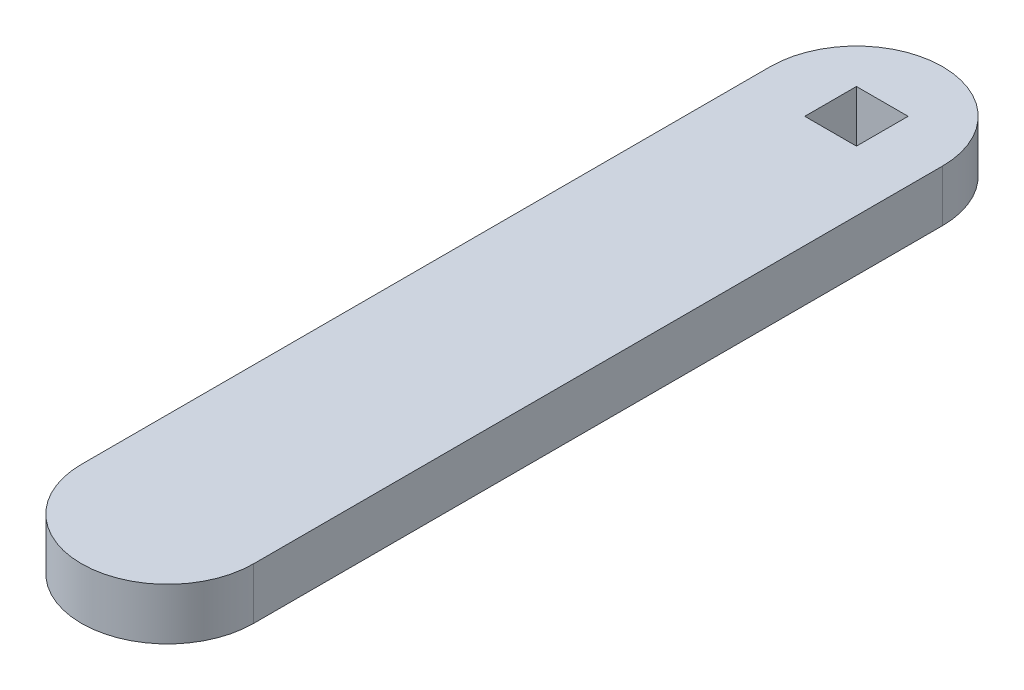
ISO-10303-21;
HEADER;
FILE_DESCRIPTION(('STEP AP214'),'2;1');
FILE_NAME('part.step','',(''),(''),'','','');
FILE_SCHEMA(('AUTOMOTIVE_DESIGN { 1 0 10303 214 1 1 1 1 }'));
ENDSEC;
DATA;
#1=APPLICATION_CONTEXT('core data for automotive mechanical design processes');
#2=APPLICATION_PROTOCOL_DEFINITION('international standard','automotive_design',2000,#1);
#3=PRODUCT_CONTEXT('',#1,'mechanical');
#4=PRODUCT('Part','Part','',(#3));
#5=PRODUCT_RELATED_PRODUCT_CATEGORY('part','',(#4));
#6=PRODUCT_DEFINITION_FORMATION('','',#4);
#7=PRODUCT_DEFINITION_CONTEXT('part definition',#1,'design');
#8=PRODUCT_DEFINITION('design','',#6,#7);
#9=PRODUCT_DEFINITION_SHAPE('','',#8);
#10=(LENGTH_UNIT() NAMED_UNIT(*) SI_UNIT(.MILLI.,.METRE.));
#11=(NAMED_UNIT(*) PLANE_ANGLE_UNIT() SI_UNIT($,.RADIAN.));
#12=(NAMED_UNIT(*) SI_UNIT($,.STERADIAN.) SOLID_ANGLE_UNIT());
#13=UNCERTAINTY_MEASURE_WITH_UNIT(LENGTH_MEASURE(1.E-05),#10,'distance_accuracy_value','');
#14=(GEOMETRIC_REPRESENTATION_CONTEXT(3) GLOBAL_UNCERTAINTY_ASSIGNED_CONTEXT((#13)) GLOBAL_UNIT_ASSIGNED_CONTEXT((#10,
#11,#12)) REPRESENTATION_CONTEXT('',''));
#15=CARTESIAN_POINT('',(0.,0.,0.));
#16=DIRECTION('',(0.,0.,1.));
#17=DIRECTION('',(1.,0.,0.));
#18=AXIS2_PLACEMENT_3D('',#15,#16,#17);
#19=CARTESIAN_POINT('',(0.,30.,-200.));
#20=DIRECTION('',(0.,-1.,0.));
#21=DIRECTION('',(0.,0.,-1.));
#22=AXIS2_PLACEMENT_3D('',#19,#20,#21);
#23=CYLINDRICAL_SURFACE('',#22,50.);
#24=CARTESIAN_POINT('',(0.,0.,-200.));
#25=DIRECTION('',(0.,1.,0.));
#26=DIRECTION('',(0.,0.,1.));
#27=AXIS2_PLACEMENT_3D('',#24,#25,#26);
#28=CIRCLE('',#27,50.);
#29=CARTESIAN_POINT('',(49.9999999999999,0.,-200.));
#30=VERTEX_POINT('',#29);
#31=CARTESIAN_POINT('',(-50.0000000000001,0.,-200.));
#32=VERTEX_POINT('',#31);
#33=EDGE_CURVE('E138',#30,#32,#28,.T.);
#34=ORIENTED_EDGE('',*,*,#33,.T.);
#35=DIRECTION('',(0.,-1.,0.));
#36=VECTOR('',#35,1.);
#37=CARTESIAN_POINT('',(-50.0000000000001,30.,-200.));
#38=LINE('',#37,#36);
#39=CARTESIAN_POINT('',(-50.0000000000001,30.,-200.));
#40=VERTEX_POINT('',#39);
#41=EDGE_CURVE('E11',#40,#32,#38,.T.);
#42=ORIENTED_EDGE('',*,*,#41,.F.);
#43=CARTESIAN_POINT('',(0.,30.,-200.));
#44=DIRECTION('',(0.,1.,0.));
#45=DIRECTION('',(0.,0.,1.));
#46=AXIS2_PLACEMENT_3D('',#43,#44,#45);
#47=CIRCLE('',#46,50.);
#48=CARTESIAN_POINT('',(49.9999999999999,30.,-200.));
#49=VERTEX_POINT('',#48);
#50=EDGE_CURVE('E142',#49,#40,#47,.T.);
#51=ORIENTED_EDGE('',*,*,#50,.F.);
#52=DIRECTION('',(0.,-1.,0.));
#53=VECTOR('',#52,1.);
#54=CARTESIAN_POINT('',(49.9999999999999,30.,-200.));
#55=LINE('',#54,#53);
#56=EDGE_CURVE('E152',#49,#30,#55,.T.);
#57=ORIENTED_EDGE('',*,*,#56,.T.);
#58=EDGE_LOOP('',(#34,#42,#51,#57));
#59=FACE_BOUND('',#58,.T.);
#60=ADVANCED_FACE('F41',(#59),#23,.T.);
#61=CARTESIAN_POINT('',(-50.0000000000001,30.,-200.));
#62=DIRECTION('',(1.,0.,0.));
#63=DIRECTION('',(0.,0.,-1.));
#64=AXIS2_PLACEMENT_3D('',#61,#62,#63);
#65=PLANE('',#64);
#66=DIRECTION('',(0.,0.,1.));
#67=VECTOR('',#66,1.);
#68=CARTESIAN_POINT('',(-50.0000000000001,0.,-200.));
#69=LINE('',#68,#67);
#70=CARTESIAN_POINT('',(-50.,0.,200.));
#71=VERTEX_POINT('',#70);
#72=EDGE_CURVE('E155',#32,#71,#69,.T.);
#73=ORIENTED_EDGE('',*,*,#72,.T.);
#74=DIRECTION('',(0.,-1.,0.));
#75=VECTOR('',#74,1.);
#76=CARTESIAN_POINT('',(-50.,30.,200.));
#77=LINE('',#76,#75);
#78=CARTESIAN_POINT('',(-50.,30.,200.));
#79=VERTEX_POINT('',#78);
#80=EDGE_CURVE('E48',#79,#71,#77,.T.);
#81=ORIENTED_EDGE('',*,*,#80,.F.);
#82=DIRECTION('',(0.,0.,1.));
#83=VECTOR('',#82,1.);
#84=CARTESIAN_POINT('',(-50.0000000000001,30.,-200.));
#85=LINE('',#84,#83);
#86=EDGE_CURVE('E145',#40,#79,#85,.T.);
#87=ORIENTED_EDGE('',*,*,#86,.F.);
#88=ORIENTED_EDGE('',*,*,#41,.T.);
#89=EDGE_LOOP('',(#73,#81,#87,#88));
#90=FACE_BOUND('',#89,.T.);
#91=ADVANCED_FACE('F183',(#90),#65,.F.);
#92=CARTESIAN_POINT('',(0.,30.,200.));
#93=DIRECTION('',(0.,-1.,0.));
#94=DIRECTION('',(0.,0.,-1.));
#95=AXIS2_PLACEMENT_3D('',#92,#93,#94);
#96=CYLINDRICAL_SURFACE('',#95,50.);
#97=CARTESIAN_POINT('',(0.,0.,200.));
#98=DIRECTION('',(0.,1.,0.));
#99=DIRECTION('',(0.,0.,1.));
#100=AXIS2_PLACEMENT_3D('',#97,#98,#99);
#101=CIRCLE('',#100,50.);
#102=CARTESIAN_POINT('',(50.,0.,200.));
#103=VERTEX_POINT('',#102);
#104=EDGE_CURVE('E157',#71,#103,#101,.T.);
#105=ORIENTED_EDGE('',*,*,#104,.T.);
#106=DIRECTION('',(0.,-1.,0.));
#107=VECTOR('',#106,1.);
#108=CARTESIAN_POINT('',(50.,30.,200.));
#109=LINE('',#108,#107);
#110=CARTESIAN_POINT('',(50.,30.,200.));
#111=VERTEX_POINT('',#110);
#112=EDGE_CURVE('E162',#111,#103,#109,.T.);
#113=ORIENTED_EDGE('',*,*,#112,.F.);
#114=CARTESIAN_POINT('',(0.,30.,200.));
#115=DIRECTION('',(0.,1.,0.));
#116=DIRECTION('',(0.,0.,1.));
#117=AXIS2_PLACEMENT_3D('',#114,#115,#116);
#118=CIRCLE('',#117,50.);
#119=EDGE_CURVE('E148',#79,#111,#118,.T.);
#120=ORIENTED_EDGE('',*,*,#119,.F.);
#121=ORIENTED_EDGE('',*,*,#80,.T.);
#122=EDGE_LOOP('',(#105,#113,#120,#121));
#123=FACE_BOUND('',#122,.T.);
#124=ADVANCED_FACE('F169',(#123),#96,.T.);
#125=CARTESIAN_POINT('',(49.9999999999999,30.,-200.));
#126=DIRECTION('',(-1.,0.,0.));
#127=DIRECTION('',(0.,0.,1.));
#128=AXIS2_PLACEMENT_3D('',#125,#126,#127);
#129=PLANE('',#128);
#130=DIRECTION('',(0.,0.,-1.));
#131=VECTOR('',#130,1.);
#132=CARTESIAN_POINT('',(49.9999999999999,0.,-200.));
#133=LINE('',#132,#131);
#134=EDGE_CURVE('E146',#103,#30,#133,.T.);
#135=ORIENTED_EDGE('',*,*,#134,.T.);
#136=ORIENTED_EDGE('',*,*,#56,.F.);
#137=DIRECTION('',(0.,0.,-1.));
#138=VECTOR('',#137,1.);
#139=CARTESIAN_POINT('',(49.9999999999999,30.,-200.));
#140=LINE('',#139,#138);
#141=EDGE_CURVE('E150',#111,#49,#140,.T.);
#142=ORIENTED_EDGE('',*,*,#141,.F.);
#143=ORIENTED_EDGE('',*,*,#112,.T.);
#144=EDGE_LOOP('',(#135,#136,#142,#143));
#145=FACE_BOUND('',#144,.T.);
#146=ADVANCED_FACE('F176',(#145),#129,.F.);
#147=CARTESIAN_POINT('',(0.,30.,-200.));
#148=DIRECTION('',(0.,1.,0.));
#149=DIRECTION('',(0.,0.,1.));
#150=AXIS2_PLACEMENT_3D('',#147,#148,#149);
#151=PLANE('',#150);
#152=DIRECTION('',(0.,0.,-1.));
#153=VECTOR('',#152,1.);
#154=CARTESIAN_POINT('',(14.9999999999999,30.,-185.));
#155=LINE('',#154,#153);
#156=CARTESIAN_POINT('',(14.9999999999999,30.,-185.));
#157=VERTEX_POINT('',#156);
#158=CARTESIAN_POINT('',(14.9999999999999,30.,-215.));
#159=VERTEX_POINT('',#158);
#160=EDGE_CURVE('E55',#157,#159,#155,.T.);
#161=ORIENTED_EDGE('',*,*,#160,.F.);
#162=DIRECTION('',(1.,0.,0.));
#163=VECTOR('',#162,1.);
#164=CARTESIAN_POINT('',(-15.0000000000001,30.,-185.));
#165=LINE('',#164,#163);
#166=CARTESIAN_POINT('',(-15.0000000000001,30.,-185.));
#167=VERTEX_POINT('',#166);
#168=EDGE_CURVE('E123',#167,#157,#165,.T.);
#169=ORIENTED_EDGE('',*,*,#168,.F.);
#170=DIRECTION('',(0.,0.,1.));
#171=VECTOR('',#170,1.);
#172=CARTESIAN_POINT('',(-15.0000000000001,30.,-185.));
#173=LINE('',#172,#171);
#174=CARTESIAN_POINT('',(-15.0000000000001,30.,-215.));
#175=VERTEX_POINT('',#174);
#176=EDGE_CURVE('E126',#175,#167,#173,.T.);
#177=ORIENTED_EDGE('',*,*,#176,.F.);
#178=DIRECTION('',(-1.,0.,0.));
#179=VECTOR('',#178,1.);
#180=CARTESIAN_POINT('',(-15.0000000000001,30.,-215.));
#181=LINE('',#180,#179);
#182=EDGE_CURVE('E132',#159,#175,#181,.T.);
#183=ORIENTED_EDGE('',*,*,#182,.F.);
#184=EDGE_LOOP('',(#161,#169,#177,#183));
#185=FACE_BOUND('',#184,.T.);
#186=ORIENTED_EDGE('',*,*,#50,.T.);
#187=ORIENTED_EDGE('',*,*,#86,.T.);
#188=ORIENTED_EDGE('',*,*,#119,.T.);
#189=ORIENTED_EDGE('',*,*,#141,.T.);
#190=EDGE_LOOP('',(#186,#187,#188,#189));
#191=FACE_BOUND('',#190,.T.);
#192=ADVANCED_FACE('F182',(#185,#191),#151,.T.);
#193=CARTESIAN_POINT('',(0.,0.,-200.));
#194=DIRECTION('',(0.,1.,0.));
#195=DIRECTION('',(0.,0.,1.));
#196=AXIS2_PLACEMENT_3D('',#193,#194,#195);
#197=PLANE('',#196);
#198=DIRECTION('',(1.,0.,0.));
#199=VECTOR('',#198,1.);
#200=CARTESIAN_POINT('',(-15.0000000000001,0.,-185.));
#201=LINE('',#200,#199);
#202=CARTESIAN_POINT('',(-15.0000000000001,0.,-185.));
#203=VERTEX_POINT('',#202);
#204=CARTESIAN_POINT('',(14.9999999999999,0.,-185.));
#205=VERTEX_POINT('',#204);
#206=EDGE_CURVE('E113',#203,#205,#201,.T.);
#207=ORIENTED_EDGE('',*,*,#206,.T.);
#208=DIRECTION('',(0.,0.,-1.));
#209=VECTOR('',#208,1.);
#210=CARTESIAN_POINT('',(14.9999999999999,0.,-185.));
#211=LINE('',#210,#209);
#212=CARTESIAN_POINT('',(14.9999999999999,0.,-215.));
#213=VERTEX_POINT('',#212);
#214=EDGE_CURVE('E107',#205,#213,#211,.T.);
#215=ORIENTED_EDGE('',*,*,#214,.T.);
#216=DIRECTION('',(-1.,0.,0.));
#217=VECTOR('',#216,1.);
#218=CARTESIAN_POINT('',(-15.0000000000001,0.,-215.));
#219=LINE('',#218,#217);
#220=CARTESIAN_POINT('',(-15.0000000000001,0.,-215.));
#221=VERTEX_POINT('',#220);
#222=EDGE_CURVE('E116',#213,#221,#219,.T.);
#223=ORIENTED_EDGE('',*,*,#222,.T.);
#224=DIRECTION('',(0.,0.,1.));
#225=VECTOR('',#224,1.);
#226=CARTESIAN_POINT('',(-15.0000000000001,0.,-185.));
#227=LINE('',#226,#225);
#228=EDGE_CURVE('E63',#221,#203,#227,.T.);
#229=ORIENTED_EDGE('',*,*,#228,.T.);
#230=EDGE_LOOP('',(#207,#215,#223,#229));
#231=FACE_BOUND('',#230,.T.);
#232=ORIENTED_EDGE('',*,*,#33,.F.);
#233=ORIENTED_EDGE('',*,*,#134,.F.);
#234=ORIENTED_EDGE('',*,*,#104,.F.);
#235=ORIENTED_EDGE('',*,*,#72,.F.);
#236=EDGE_LOOP('',(#232,#233,#234,#235));
#237=FACE_BOUND('',#236,.T.);
#238=ADVANCED_FACE('F120',(#231,#237),#197,.F.);
#239=CARTESIAN_POINT('',(14.9999999999999,0.,-185.));
#240=DIRECTION('',(1.,0.,0.));
#241=DIRECTION('',(0.,0.,-1.));
#242=AXIS2_PLACEMENT_3D('',#239,#240,#241);
#243=PLANE('',#242);
#244=ORIENTED_EDGE('',*,*,#160,.T.);
#245=DIRECTION('',(0.,1.,0.));
#246=VECTOR('',#245,1.);
#247=CARTESIAN_POINT('',(14.9999999999999,0.,-215.));
#248=LINE('',#247,#246);
#249=EDGE_CURVE('E103',#213,#159,#248,.T.);
#250=ORIENTED_EDGE('',*,*,#249,.F.);
#251=ORIENTED_EDGE('',*,*,#214,.F.);
#252=DIRECTION('',(0.,1.,0.));
#253=VECTOR('',#252,1.);
#254=CARTESIAN_POINT('',(14.9999999999999,0.,-185.));
#255=LINE('',#254,#253);
#256=EDGE_CURVE('E136',#205,#157,#255,.T.);
#257=ORIENTED_EDGE('',*,*,#256,.T.);
#258=EDGE_LOOP('',(#244,#250,#251,#257));
#259=FACE_BOUND('',#258,.T.);
#260=ADVANCED_FACE('F105',(#259),#243,.F.);
#261=CARTESIAN_POINT('',(-15.0000000000001,0.,-185.));
#262=DIRECTION('',(0.,0.,1.));
#263=DIRECTION('',(1.,0.,0.));
#264=AXIS2_PLACEMENT_3D('',#261,#262,#263);
#265=PLANE('',#264);
#266=ORIENTED_EDGE('',*,*,#168,.T.);
#267=ORIENTED_EDGE('',*,*,#256,.F.);
#268=ORIENTED_EDGE('',*,*,#206,.F.);
#269=DIRECTION('',(0.,1.,0.));
#270=VECTOR('',#269,1.);
#271=CARTESIAN_POINT('',(-15.0000000000001,0.,-185.));
#272=LINE('',#271,#270);
#273=EDGE_CURVE('E139',#203,#167,#272,.T.);
#274=ORIENTED_EDGE('',*,*,#273,.T.);
#275=EDGE_LOOP('',(#266,#267,#268,#274));
#276=FACE_BOUND('',#275,.T.);
#277=ADVANCED_FACE('F200',(#276),#265,.F.);
#278=CARTESIAN_POINT('',(-15.0000000000001,0.,-185.));
#279=DIRECTION('',(-1.,0.,0.));
#280=DIRECTION('',(0.,0.,1.));
#281=AXIS2_PLACEMENT_3D('',#278,#279,#280);
#282=PLANE('',#281);
#283=ORIENTED_EDGE('',*,*,#176,.T.);
#284=ORIENTED_EDGE('',*,*,#273,.F.);
#285=ORIENTED_EDGE('',*,*,#228,.F.);
#286=DIRECTION('',(0.,1.,0.));
#287=VECTOR('',#286,1.);
#288=CARTESIAN_POINT('',(-15.0000000000001,0.,-215.));
#289=LINE('',#288,#287);
#290=EDGE_CURVE('E112',#221,#175,#289,.T.);
#291=ORIENTED_EDGE('',*,*,#290,.T.);
#292=EDGE_LOOP('',(#283,#284,#285,#291));
#293=FACE_BOUND('',#292,.T.);
#294=ADVANCED_FACE('F203',(#293),#282,.F.);
#295=CARTESIAN_POINT('',(-15.0000000000001,0.,-215.));
#296=DIRECTION('',(0.,0.,-1.));
#297=DIRECTION('',(-1.,0.,0.));
#298=AXIS2_PLACEMENT_3D('',#295,#296,#297);
#299=PLANE('',#298);
#300=ORIENTED_EDGE('',*,*,#182,.T.);
#301=ORIENTED_EDGE('',*,*,#290,.F.);
#302=ORIENTED_EDGE('',*,*,#222,.F.);
#303=ORIENTED_EDGE('',*,*,#249,.T.);
#304=EDGE_LOOP('',(#300,#301,#302,#303));
#305=FACE_BOUND('',#304,.T.);
#306=ADVANCED_FACE('F117',(#305),#299,.F.);
#307=CLOSED_SHELL('',(#60,#91,#124,#146,#192,#238,#260,#277,#294,#306));
#308=MANIFOLD_SOLID_BREP('B2',#307);
#309=ADVANCED_BREP_SHAPE_REPRESENTATION('',(#18,#308),#14);
#310=SHAPE_DEFINITION_REPRESENTATION(#9,#309);
ENDSEC;
END-ISO-10303-21;
